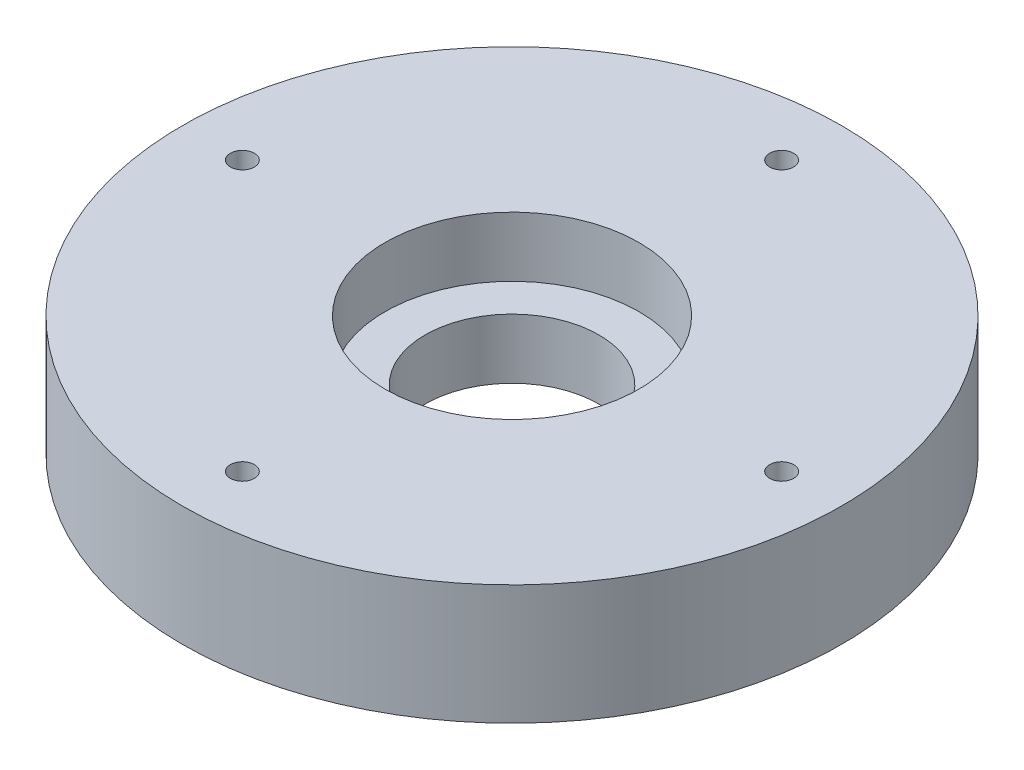
ISO-10303-21;
HEADER;
FILE_DESCRIPTION(('STEP AP214'),'2;1');
FILE_NAME('part.step','',(''),(''),'','','');
FILE_SCHEMA(('AUTOMOTIVE_DESIGN { 1 0 10303 214 1 1 1 1 }'));
ENDSEC;
DATA;
#1=APPLICATION_CONTEXT('core data for automotive mechanical design processes');
#2=APPLICATION_PROTOCOL_DEFINITION('international standard','automotive_design',2000,#1);
#3=PRODUCT_CONTEXT('',#1,'mechanical');
#4=PRODUCT('Part','Part','',(#3));
#5=PRODUCT_RELATED_PRODUCT_CATEGORY('part','',(#4));
#6=PRODUCT_DEFINITION_FORMATION('','',#4);
#7=PRODUCT_DEFINITION_CONTEXT('part definition',#1,'design');
#8=PRODUCT_DEFINITION('design','',#6,#7);
#9=PRODUCT_DEFINITION_SHAPE('','',#8);
#10=(LENGTH_UNIT() NAMED_UNIT(*) SI_UNIT(.MILLI.,.METRE.));
#11=(NAMED_UNIT(*) PLANE_ANGLE_UNIT() SI_UNIT($,.RADIAN.));
#12=(NAMED_UNIT(*) SI_UNIT($,.STERADIAN.) SOLID_ANGLE_UNIT());
#13=UNCERTAINTY_MEASURE_WITH_UNIT(LENGTH_MEASURE(1.E-05),#10,'distance_accuracy_value','');
#14=(GEOMETRIC_REPRESENTATION_CONTEXT(3) GLOBAL_UNCERTAINTY_ASSIGNED_CONTEXT((#13)) GLOBAL_UNIT_ASSIGNED_CONTEXT((#10,
#11,#12)) REPRESENTATION_CONTEXT('',''));
#15=CARTESIAN_POINT('',(0.,0.,0.));
#16=DIRECTION('',(0.,0.,1.));
#17=DIRECTION('',(1.,0.,0.));
#18=AXIS2_PLACEMENT_3D('',#15,#16,#17);
#19=CARTESIAN_POINT('',(0.,0.,-45.));
#20=DIRECTION('',(0.,1.,0.));
#21=DIRECTION('',(0.,0.,1.));
#22=AXIS2_PLACEMENT_3D('',#19,#20,#21);
#23=CYLINDRICAL_SURFACE('',#22,2.);
#24=CARTESIAN_POINT('',(0.,20.,-45.));
#25=DIRECTION('',(0.,1.,0.));
#26=DIRECTION('',(0.,0.,1.));
#27=AXIS2_PLACEMENT_3D('',#24,#25,#26);
#28=CIRCLE('',#27,2.);
#29=CARTESIAN_POINT('',(0.,20.,-43.));
#30=VERTEX_POINT('',#29);
#31=EDGE_CURVE('E96',#30,#30,#28,.T.);
#32=ORIENTED_EDGE('',*,*,#31,.T.);
#33=EDGE_LOOP('',(#32));
#34=FACE_BOUND('',#33,.T.);
#35=CARTESIAN_POINT('',(0.,5.,-45.));
#36=DIRECTION('',(0.,-1.,0.));
#37=DIRECTION('',(0.,0.,-1.));
#38=AXIS2_PLACEMENT_3D('',#35,#36,#37);
#39=CIRCLE('',#38,2.);
#40=CARTESIAN_POINT('',(0.,5.,-47.));
#41=VERTEX_POINT('',#40);
#42=EDGE_CURVE('E41',#41,#41,#39,.F.);
#43=ORIENTED_EDGE('',*,*,#42,.F.);
#44=EDGE_LOOP('',(#43));
#45=FACE_BOUND('',#44,.T.);
#46=ADVANCED_FACE('F37',(#34,#45),#23,.F.);
#47=CARTESIAN_POINT('',(-44.9999999999987,0.,1.27897692436818E-12));
#48=DIRECTION('',(0.,1.,0.));
#49=DIRECTION('',(0.,0.,1.));
#50=AXIS2_PLACEMENT_3D('',#47,#48,#49);
#51=CYLINDRICAL_SURFACE('',#50,2.);
#52=CARTESIAN_POINT('',(-44.9999999999987,20.,1.27897692436818E-12));
#53=DIRECTION('',(0.,1.,0.));
#54=DIRECTION('',(0.,0.,1.));
#55=AXIS2_PLACEMENT_3D('',#52,#53,#54);
#56=CIRCLE('',#55,2.);
#57=CARTESIAN_POINT('',(-44.9999999999987,20.,2.00000000000128));
#58=VERTEX_POINT('',#57);
#59=EDGE_CURVE('E66',#58,#58,#56,.T.);
#60=ORIENTED_EDGE('',*,*,#59,.T.);
#61=EDGE_LOOP('',(#60));
#62=FACE_BOUND('',#61,.T.);
#63=CARTESIAN_POINT('',(-44.9999999999987,5.,1.27897692436818E-12));
#64=DIRECTION('',(0.,-1.,0.));
#65=DIRECTION('',(0.,0.,-1.));
#66=AXIS2_PLACEMENT_3D('',#63,#64,#65);
#67=CIRCLE('',#66,2.);
#68=CARTESIAN_POINT('',(-44.9999999999987,5.,-1.99999999999872));
#69=VERTEX_POINT('',#68);
#70=EDGE_CURVE('E71',#69,#69,#67,.F.);
#71=ORIENTED_EDGE('',*,*,#70,.F.);
#72=EDGE_LOOP('',(#71));
#73=FACE_BOUND('',#72,.T.);
#74=ADVANCED_FACE('F133',(#62,#73),#51,.F.);
#75=CARTESIAN_POINT('',(45.0000000000013,0.,-1.27346601377202E-12));
#76=DIRECTION('',(0.,1.,0.));
#77=DIRECTION('',(0.,0.,1.));
#78=AXIS2_PLACEMENT_3D('',#75,#76,#77);
#79=CYLINDRICAL_SURFACE('',#78,2.);
#80=CARTESIAN_POINT('',(45.0000000000013,20.,-1.27346601377202E-12));
#81=DIRECTION('',(0.,1.,0.));
#82=DIRECTION('',(0.,0.,1.));
#83=AXIS2_PLACEMENT_3D('',#80,#81,#82);
#84=CIRCLE('',#83,2.);
#85=CARTESIAN_POINT('',(45.0000000000013,20.,1.99999999999873));
#86=VERTEX_POINT('',#85);
#87=EDGE_CURVE('E92',#86,#86,#84,.T.);
#88=ORIENTED_EDGE('',*,*,#87,.T.);
#89=EDGE_LOOP('',(#88));
#90=FACE_BOUND('',#89,.T.);
#91=CARTESIAN_POINT('',(45.0000000000013,5.,-1.27346601377202E-12));
#92=DIRECTION('',(0.,-1.,0.));
#93=DIRECTION('',(0.,0.,-1.));
#94=AXIS2_PLACEMENT_3D('',#91,#92,#93);
#95=CIRCLE('',#94,2.);
#96=CARTESIAN_POINT('',(45.0000000000013,5.,-2.00000000000128));
#97=VERTEX_POINT('',#96);
#98=EDGE_CURVE('E68',#97,#97,#95,.F.);
#99=ORIENTED_EDGE('',*,*,#98,.F.);
#100=EDGE_LOOP('',(#99));
#101=FACE_BOUND('',#100,.T.);
#102=ADVANCED_FACE('F139',(#90,#101),#79,.F.);
#103=CARTESIAN_POINT('',(2.54693202754403E-12,0.,45.));
#104=DIRECTION('',(0.,1.,0.));
#105=DIRECTION('',(0.,0.,1.));
#106=AXIS2_PLACEMENT_3D('',#103,#104,#105);
#107=CYLINDRICAL_SURFACE('',#106,2.);
#108=CARTESIAN_POINT('',(2.54693202754403E-12,20.,45.));
#109=DIRECTION('',(0.,1.,0.));
#110=DIRECTION('',(0.,0.,1.));
#111=AXIS2_PLACEMENT_3D('',#108,#109,#110);
#112=CIRCLE('',#111,2.);
#113=CARTESIAN_POINT('',(2.54693202754403E-12,20.,47.));
#114=VERTEX_POINT('',#113);
#115=EDGE_CURVE('E97',#114,#114,#112,.T.);
#116=ORIENTED_EDGE('',*,*,#115,.T.);
#117=EDGE_LOOP('',(#116));
#118=FACE_BOUND('',#117,.T.);
#119=CARTESIAN_POINT('',(2.54693202754403E-12,5.,45.));
#120=DIRECTION('',(0.,-1.,0.));
#121=DIRECTION('',(0.,0.,-1.));
#122=AXIS2_PLACEMENT_3D('',#119,#120,#121);
#123=CIRCLE('',#122,2.);
#124=CARTESIAN_POINT('',(2.54693202754403E-12,5.,43.));
#125=VERTEX_POINT('',#124);
#126=EDGE_CURVE('E62',#125,#125,#123,.F.);
#127=ORIENTED_EDGE('',*,*,#126,.F.);
#128=EDGE_LOOP('',(#127));
#129=FACE_BOUND('',#128,.T.);
#130=ADVANCED_FACE('F127',(#118,#129),#107,.F.);
#131=CARTESIAN_POINT('',(0.,20.,0.));
#132=DIRECTION('',(0.,-1.,0.));
#133=DIRECTION('',(0.,0.,-1.));
#134=AXIS2_PLACEMENT_3D('',#131,#132,#133);
#135=CYLINDRICAL_SURFACE('',#134,14.5);
#136=CARTESIAN_POINT('',(0.,0.,0.));
#137=DIRECTION('',(0.,1.,0.));
#138=DIRECTION('',(0.,0.,1.));
#139=AXIS2_PLACEMENT_3D('',#136,#137,#138);
#140=CIRCLE('',#139,14.5);
#141=CARTESIAN_POINT('',(0.,0.,14.5));
#142=VERTEX_POINT('',#141);
#143=EDGE_CURVE('E52',#142,#142,#140,.T.);
#144=ORIENTED_EDGE('',*,*,#143,.F.);
#145=EDGE_LOOP('',(#144));
#146=FACE_BOUND('',#145,.T.);
#147=CARTESIAN_POINT('',(0.,10.,0.));
#148=DIRECTION('',(0.,1.,0.));
#149=DIRECTION('',(0.,0.,1.));
#150=AXIS2_PLACEMENT_3D('',#147,#148,#149);
#151=CIRCLE('',#150,14.5);
#152=CARTESIAN_POINT('',(0.,10.,14.5));
#153=VERTEX_POINT('',#152);
#154=EDGE_CURVE('E57',#153,#153,#151,.T.);
#155=ORIENTED_EDGE('',*,*,#154,.T.);
#156=EDGE_LOOP('',(#155));
#157=FACE_BOUND('',#156,.T.);
#158=ADVANCED_FACE('F119',(#146,#157),#135,.F.);
#159=CARTESIAN_POINT('',(0.,20.,0.));
#160=DIRECTION('',(0.,1.,0.));
#161=DIRECTION('',(0.,0.,1.));
#162=AXIS2_PLACEMENT_3D('',#159,#160,#161);
#163=PLANE('',#162);
#164=ORIENTED_EDGE('',*,*,#87,.F.);
#165=EDGE_LOOP('',(#164));
#166=FACE_BOUND('',#165,.T.);
#167=ORIENTED_EDGE('',*,*,#115,.F.);
#168=EDGE_LOOP('',(#167));
#169=FACE_BOUND('',#168,.T.);
#170=ORIENTED_EDGE('',*,*,#59,.F.);
#171=EDGE_LOOP('',(#170));
#172=FACE_BOUND('',#171,.T.);
#173=ORIENTED_EDGE('',*,*,#31,.F.);
#174=EDGE_LOOP('',(#173));
#175=FACE_BOUND('',#174,.T.);
#176=CARTESIAN_POINT('',(0.,20.,0.));
#177=DIRECTION('',(0.,1.,0.));
#178=DIRECTION('',(0.,0.,1.));
#179=AXIS2_PLACEMENT_3D('',#176,#177,#178);
#180=CIRCLE('',#179,21.2);
#181=CARTESIAN_POINT('',(0.,20.,21.2));
#182=VERTEX_POINT('',#181);
#183=EDGE_CURVE('E107',#182,#182,#180,.T.);
#184=ORIENTED_EDGE('',*,*,#183,.F.);
#185=EDGE_LOOP('',(#184));
#186=FACE_BOUND('',#185,.T.);
#187=CARTESIAN_POINT('',(0.,20.,0.));
#188=DIRECTION('',(0.,1.,0.));
#189=DIRECTION('',(0.,0.,1.));
#190=AXIS2_PLACEMENT_3D('',#187,#188,#189);
#191=CIRCLE('',#190,55.);
#192=CARTESIAN_POINT('',(0.,20.,55.));
#193=VERTEX_POINT('',#192);
#194=EDGE_CURVE('E10',#193,#193,#191,.T.);
#195=ORIENTED_EDGE('',*,*,#194,.T.);
#196=EDGE_LOOP('',(#195));
#197=FACE_BOUND('',#196,.T.);
#198=ADVANCED_FACE('F116',(#166,#169,#172,#175,#186,#197),#163,.T.);
#199=CARTESIAN_POINT('',(0.,0.,0.));
#200=DIRECTION('',(0.,1.,0.));
#201=DIRECTION('',(0.,0.,1.));
#202=AXIS2_PLACEMENT_3D('',#199,#200,#201);
#203=PLANE('',#202);
#204=CARTESIAN_POINT('',(45.0000000000013,0.,-1.28448783496434E-12));
#205=DIRECTION('',(0.,-1.,0.));
#206=DIRECTION('',(0.,0.,-1.));
#207=AXIS2_PLACEMENT_3D('',#204,#205,#206);
#208=CIRCLE('',#207,5.00000000000099);
#209=CARTESIAN_POINT('',(45.0000000000013,0.,-5.00000000000227));
#210=VERTEX_POINT('',#209);
#211=EDGE_CURVE('E330',#210,#210,#208,.T.);
#212=ORIENTED_EDGE('',*,*,#211,.F.);
#213=EDGE_LOOP('',(#212));
#214=FACE_BOUND('',#213,.T.);
#215=CARTESIAN_POINT('',(0.,0.,-45.));
#216=DIRECTION('',(0.,-1.,0.));
#217=DIRECTION('',(0.,0.,-1.));
#218=AXIS2_PLACEMENT_3D('',#215,#216,#217);
#219=CIRCLE('',#218,5.00000000000271);
#220=CARTESIAN_POINT('',(0.,0.,-50.0000000000027));
#221=VERTEX_POINT('',#220);
#222=EDGE_CURVE('E323',#221,#221,#219,.T.);
#223=ORIENTED_EDGE('',*,*,#222,.F.);
#224=EDGE_LOOP('',(#223));
#225=FACE_BOUND('',#224,.T.);
#226=CARTESIAN_POINT('',(-44.9999999999987,0.,1.27897692436818E-12));
#227=DIRECTION('',(0.,-1.,0.));
#228=DIRECTION('',(0.,0.,-1.));
#229=AXIS2_PLACEMENT_3D('',#226,#227,#228);
#230=CIRCLE('',#229,5.00000000000203);
#231=CARTESIAN_POINT('',(-44.9999999999987,0.,-5.00000000000075));
#232=VERTEX_POINT('',#231);
#233=EDGE_CURVE('E333',#232,#232,#230,.T.);
#234=ORIENTED_EDGE('',*,*,#233,.F.);
#235=EDGE_LOOP('',(#234));
#236=FACE_BOUND('',#235,.T.);
#237=CARTESIAN_POINT('',(2.54693202754403E-12,0.,45.));
#238=DIRECTION('',(0.,-1.,0.));
#239=DIRECTION('',(0.,0.,-1.));
#240=AXIS2_PLACEMENT_3D('',#237,#238,#239);
#241=CIRCLE('',#240,5.);
#242=CARTESIAN_POINT('',(2.54693202754403E-12,0.,40.));
#243=VERTEX_POINT('',#242);
#244=EDGE_CURVE('E79',#243,#243,#241,.T.);
#245=ORIENTED_EDGE('',*,*,#244,.F.);
#246=EDGE_LOOP('',(#245));
#247=FACE_BOUND('',#246,.T.);
#248=CARTESIAN_POINT('',(0.,0.,0.));
#249=DIRECTION('',(0.,1.,0.));
#250=DIRECTION('',(0.,0.,1.));
#251=AXIS2_PLACEMENT_3D('',#248,#249,#250);
#252=CIRCLE('',#251,55.);
#253=CARTESIAN_POINT('',(0.,0.,55.));
#254=VERTEX_POINT('',#253);
#255=EDGE_CURVE('E46',#254,#254,#252,.T.);
#256=ORIENTED_EDGE('',*,*,#255,.F.);
#257=EDGE_LOOP('',(#256));
#258=FACE_BOUND('',#257,.T.);
#259=ORIENTED_EDGE('',*,*,#143,.T.);
#260=EDGE_LOOP('',(#259));
#261=FACE_BOUND('',#260,.T.);
#262=ADVANCED_FACE('F118',(#214,#225,#236,#247,#258,#261),#203,.F.);
#263=CARTESIAN_POINT('',(0.,20.,0.));
#264=DIRECTION('',(0.,-1.,0.));
#265=DIRECTION('',(0.,0.,-1.));
#266=AXIS2_PLACEMENT_3D('',#263,#264,#265);
#267=CYLINDRICAL_SURFACE('',#266,55.);
#268=ORIENTED_EDGE('',*,*,#194,.F.);
#269=EDGE_LOOP('',(#268));
#270=FACE_BOUND('',#269,.T.);
#271=ORIENTED_EDGE('',*,*,#255,.T.);
#272=EDGE_LOOP('',(#271));
#273=FACE_BOUND('',#272,.T.);
#274=ADVANCED_FACE('F39',(#270,#273),#267,.T.);
#275=CARTESIAN_POINT('',(0.,10.,0.));
#276=DIRECTION('',(0.,1.,0.));
#277=DIRECTION('',(0.,0.,1.));
#278=AXIS2_PLACEMENT_3D('',#275,#276,#277);
#279=CYLINDRICAL_SURFACE('',#278,21.2);
#280=CARTESIAN_POINT('',(0.,10.,0.));
#281=DIRECTION('',(0.,1.,0.));
#282=DIRECTION('',(0.,0.,1.));
#283=AXIS2_PLACEMENT_3D('',#280,#281,#282);
#284=CIRCLE('',#283,21.2);
#285=CARTESIAN_POINT('',(0.,10.,21.2));
#286=VERTEX_POINT('',#285);
#287=EDGE_CURVE('E61',#286,#286,#284,.T.);
#288=ORIENTED_EDGE('',*,*,#287,.F.);
#289=EDGE_LOOP('',(#288));
#290=FACE_BOUND('',#289,.T.);
#291=ORIENTED_EDGE('',*,*,#183,.T.);
#292=EDGE_LOOP('',(#291));
#293=FACE_BOUND('',#292,.T.);
#294=ADVANCED_FACE('F114',(#290,#293),#279,.F.);
#295=CARTESIAN_POINT('',(0.,10.,0.));
#296=DIRECTION('',(0.,1.,0.));
#297=DIRECTION('',(0.,0.,1.));
#298=AXIS2_PLACEMENT_3D('',#295,#296,#297);
#299=PLANE('',#298);
#300=ORIENTED_EDGE('',*,*,#154,.F.);
#301=EDGE_LOOP('',(#300));
#302=FACE_BOUND('',#301,.T.);
#303=ORIENTED_EDGE('',*,*,#287,.T.);
#304=EDGE_LOOP('',(#303));
#305=FACE_BOUND('',#304,.T.);
#306=ADVANCED_FACE('F145',(#302,#305),#299,.T.);
#307=CARTESIAN_POINT('',(2.54693202754403E-12,5.,45.));
#308=DIRECTION('',(0.,-1.,0.));
#309=DIRECTION('',(0.,0.,-1.));
#310=AXIS2_PLACEMENT_3D('',#307,#308,#309);
#311=PLANE('',#310);
#312=CARTESIAN_POINT('',(2.54693202754403E-12,5.,45.));
#313=DIRECTION('',(0.,-1.,0.));
#314=DIRECTION('',(0.,0.,-1.));
#315=AXIS2_PLACEMENT_3D('',#312,#313,#314);
#316=CIRCLE('',#315,5.);
#317=CARTESIAN_POINT('',(2.54693202754403E-12,5.,40.));
#318=VERTEX_POINT('',#317);
#319=EDGE_CURVE('E67',#318,#318,#316,.T.);
#320=ORIENTED_EDGE('',*,*,#319,.T.);
#321=EDGE_LOOP('',(#320));
#322=FACE_BOUND('',#321,.T.);
#323=ORIENTED_EDGE('',*,*,#126,.T.);
#324=EDGE_LOOP('',(#323));
#325=FACE_BOUND('',#324,.T.);
#326=ADVANCED_FACE('F148',(#322,#325),#311,.T.);
#327=CARTESIAN_POINT('',(2.54693202754403E-12,5.,45.));
#328=DIRECTION('',(0.,-1.,0.));
#329=DIRECTION('',(0.,0.,-1.));
#330=AXIS2_PLACEMENT_3D('',#327,#328,#329);
#331=CYLINDRICAL_SURFACE('',#330,5.);
#332=ORIENTED_EDGE('',*,*,#319,.F.);
#333=EDGE_LOOP('',(#332));
#334=FACE_BOUND('',#333,.T.);
#335=ORIENTED_EDGE('',*,*,#244,.T.);
#336=EDGE_LOOP('',(#335));
#337=FACE_BOUND('',#336,.T.);
#338=ADVANCED_FACE('F189',(#334,#337),#331,.F.);
#339=CARTESIAN_POINT('',(45.0000000000013,5.,-1.28448783496434E-12));
#340=DIRECTION('',(0.,-1.,0.));
#341=DIRECTION('',(0.,0.,-1.));
#342=AXIS2_PLACEMENT_3D('',#339,#340,#341);
#343=PLANE('',#342);
#344=CARTESIAN_POINT('',(45.0000000000013,5.,-1.28448783496434E-12));
#345=DIRECTION('',(0.,-1.,0.));
#346=DIRECTION('',(0.,0.,-1.));
#347=AXIS2_PLACEMENT_3D('',#344,#345,#346);
#348=CIRCLE('',#347,5.00000000000099);
#349=CARTESIAN_POINT('',(45.0000000000013,5.,-5.00000000000227));
#350=VERTEX_POINT('',#349);
#351=EDGE_CURVE('E72',#350,#350,#348,.T.);
#352=ORIENTED_EDGE('',*,*,#351,.T.);
#353=EDGE_LOOP('',(#352));
#354=FACE_BOUND('',#353,.T.);
#355=ORIENTED_EDGE('',*,*,#98,.T.);
#356=EDGE_LOOP('',(#355));
#357=FACE_BOUND('',#356,.T.);
#358=ADVANCED_FACE('F200',(#354,#357),#343,.T.);
#359=CARTESIAN_POINT('',(45.0000000000013,5.,-1.28448783496434E-12));
#360=DIRECTION('',(0.,-1.,0.));
#361=DIRECTION('',(0.,0.,-1.));
#362=AXIS2_PLACEMENT_3D('',#359,#360,#361);
#363=CYLINDRICAL_SURFACE('',#362,5.00000000000099);
#364=ORIENTED_EDGE('',*,*,#351,.F.);
#365=EDGE_LOOP('',(#364));
#366=FACE_BOUND('',#365,.T.);
#367=ORIENTED_EDGE('',*,*,#211,.T.);
#368=EDGE_LOOP('',(#367));
#369=FACE_BOUND('',#368,.T.);
#370=ADVANCED_FACE('F210',(#366,#369),#363,.F.);
#371=CARTESIAN_POINT('',(-44.9999999999987,5.,1.27897692436818E-12));
#372=DIRECTION('',(0.,-1.,0.));
#373=DIRECTION('',(0.,0.,-1.));
#374=AXIS2_PLACEMENT_3D('',#371,#372,#373);
#375=PLANE('',#374);
#376=CARTESIAN_POINT('',(-44.9999999999987,5.,1.27897692436818E-12));
#377=DIRECTION('',(0.,-1.,0.));
#378=DIRECTION('',(0.,0.,-1.));
#379=AXIS2_PLACEMENT_3D('',#376,#377,#378);
#380=CIRCLE('',#379,5.00000000000203);
#381=CARTESIAN_POINT('',(-44.9999999999987,5.,-5.00000000000075));
#382=VERTEX_POINT('',#381);
#383=EDGE_CURVE('E326',#382,#382,#380,.T.);
#384=ORIENTED_EDGE('',*,*,#383,.T.);
#385=EDGE_LOOP('',(#384));
#386=FACE_BOUND('',#385,.T.);
#387=ORIENTED_EDGE('',*,*,#70,.T.);
#388=EDGE_LOOP('',(#387));
#389=FACE_BOUND('',#388,.T.);
#390=ADVANCED_FACE('F220',(#386,#389),#375,.T.);
#391=CARTESIAN_POINT('',(-44.9999999999987,5.,1.27897692436818E-12));
#392=DIRECTION('',(0.,-1.,0.));
#393=DIRECTION('',(0.,0.,-1.));
#394=AXIS2_PLACEMENT_3D('',#391,#392,#393);
#395=CYLINDRICAL_SURFACE('',#394,5.00000000000203);
#396=ORIENTED_EDGE('',*,*,#383,.F.);
#397=EDGE_LOOP('',(#396));
#398=FACE_BOUND('',#397,.T.);
#399=ORIENTED_EDGE('',*,*,#233,.T.);
#400=EDGE_LOOP('',(#399));
#401=FACE_BOUND('',#400,.T.);
#402=ADVANCED_FACE('F230',(#398,#401),#395,.F.);
#403=CARTESIAN_POINT('',(0.,5.,-45.));
#404=DIRECTION('',(0.,-1.,0.));
#405=DIRECTION('',(0.,0.,-1.));
#406=AXIS2_PLACEMENT_3D('',#403,#404,#405);
#407=PLANE('',#406);
#408=CARTESIAN_POINT('',(0.,5.,-45.));
#409=DIRECTION('',(0.,-1.,0.));
#410=DIRECTION('',(0.,0.,-1.));
#411=AXIS2_PLACEMENT_3D('',#408,#409,#410);
#412=CIRCLE('',#411,5.00000000000271);
#413=CARTESIAN_POINT('',(0.,5.,-50.0000000000027));
#414=VERTEX_POINT('',#413);
#415=EDGE_CURVE('E320',#414,#414,#412,.T.);
#416=ORIENTED_EDGE('',*,*,#415,.T.);
#417=EDGE_LOOP('',(#416));
#418=FACE_BOUND('',#417,.T.);
#419=ORIENTED_EDGE('',*,*,#42,.T.);
#420=EDGE_LOOP('',(#419));
#421=FACE_BOUND('',#420,.T.);
#422=ADVANCED_FACE('F240',(#418,#421),#407,.T.);
#423=CARTESIAN_POINT('',(0.,5.,-45.));
#424=DIRECTION('',(0.,-1.,0.));
#425=DIRECTION('',(0.,0.,-1.));
#426=AXIS2_PLACEMENT_3D('',#423,#424,#425);
#427=CYLINDRICAL_SURFACE('',#426,5.00000000000271);
#428=ORIENTED_EDGE('',*,*,#415,.F.);
#429=EDGE_LOOP('',(#428));
#430=FACE_BOUND('',#429,.T.);
#431=ORIENTED_EDGE('',*,*,#222,.T.);
#432=EDGE_LOOP('',(#431));
#433=FACE_BOUND('',#432,.T.);
#434=ADVANCED_FACE('F250',(#430,#433),#427,.F.);
#435=CLOSED_SHELL('',(#46,#74,#102,#130,#158,#198,#262,#274,#294,#306,#326,#338,#358,#370,#390,
#402,#422,#434));
#436=MANIFOLD_SOLID_BREP('B2',#435);
#437=ADVANCED_BREP_SHAPE_REPRESENTATION('',(#18,#436),#14);
#438=SHAPE_DEFINITION_REPRESENTATION(#9,#437);
ENDSEC;
END-ISO-10303-21;
